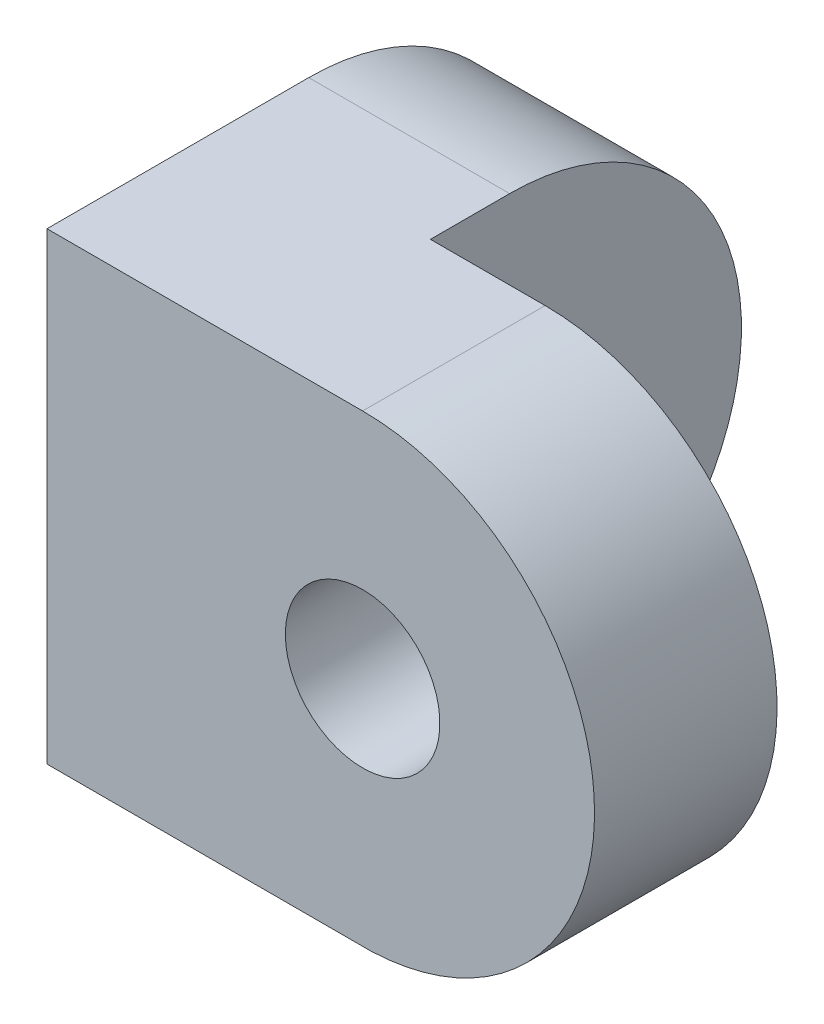
ISO-10303-21;
HEADER;
FILE_DESCRIPTION(('STEP AP214'),'2;1');
FILE_NAME('part.step','',(''),(''),'','','');
FILE_SCHEMA(('AUTOMOTIVE_DESIGN { 1 0 10303 214 1 1 1 1 }'));
ENDSEC;
DATA;
#1=APPLICATION_CONTEXT('core data for automotive mechanical design processes');
#2=APPLICATION_PROTOCOL_DEFINITION('international standard','automotive_design',2000,#1);
#3=PRODUCT_CONTEXT('',#1,'mechanical');
#4=PRODUCT('Part','Part','',(#3));
#5=PRODUCT_RELATED_PRODUCT_CATEGORY('part','',(#4));
#6=PRODUCT_DEFINITION_FORMATION('','',#4);
#7=PRODUCT_DEFINITION_CONTEXT('part definition',#1,'design');
#8=PRODUCT_DEFINITION('design','',#6,#7);
#9=PRODUCT_DEFINITION_SHAPE('','',#8);
#10=(LENGTH_UNIT() NAMED_UNIT(*) SI_UNIT(.MILLI.,.METRE.));
#11=(NAMED_UNIT(*) PLANE_ANGLE_UNIT() SI_UNIT($,.RADIAN.));
#12=(NAMED_UNIT(*) SI_UNIT($,.STERADIAN.) SOLID_ANGLE_UNIT());
#13=UNCERTAINTY_MEASURE_WITH_UNIT(LENGTH_MEASURE(1.E-05),#10,'distance_accuracy_value','');
#14=(GEOMETRIC_REPRESENTATION_CONTEXT(3) GLOBAL_UNCERTAINTY_ASSIGNED_CONTEXT((#13)) GLOBAL_UNIT_ASSIGNED_CONTEXT((#10,
#11,#12)) REPRESENTATION_CONTEXT('',''));
#15=CARTESIAN_POINT('',(0.,0.,0.));
#16=DIRECTION('',(0.,0.,1.));
#17=DIRECTION('',(1.,0.,0.));
#18=AXIS2_PLACEMENT_3D('',#15,#16,#17);
#19=CARTESIAN_POINT('',(0.,0.,-1.35000000000002));
#20=DIRECTION('',(0.,0.,-1.));
#21=DIRECTION('',(-1.,0.,0.));
#22=AXIS2_PLACEMENT_3D('',#19,#20,#21);
#23=PLANE('',#22);
#24=CARTESIAN_POINT('',(9.4278470507973,-0.00660032409642401,-1.35000000000002));
#25=DIRECTION('',(0.,0.,-1.));
#26=DIRECTION('',(-1.,0.,0.));
#27=AXIS2_PLACEMENT_3D('',#24,#25,#26);
#28=CIRCLE('',#27,6.35);
#29=CARTESIAN_POINT('',(3.0778470507973,-0.00660032409642401,-1.35000000000002));
#30=VERTEX_POINT('',#29);
#31=EDGE_CURVE('E198',#30,#30,#28,.T.);
#32=ORIENTED_EDGE('',*,*,#31,.T.);
#33=EDGE_LOOP('',(#32));
#34=FACE_BOUND('',#33,.T.);
#35=DIRECTION('',(1.,0.,0.));
#36=VECTOR('',#35,1.);
#37=CARTESIAN_POINT('',(-16.51,-19.05,-1.35000000000002));
#38=LINE('',#37,#36);
#39=CARTESIAN_POINT('',(-16.51,-19.05,-1.35000000000002));
#40=VERTEX_POINT('',#39);
#41=CARTESIAN_POINT('',(10.1370329898484,-19.05,-1.35000000000002));
#42=VERTEX_POINT('',#41);
#43=EDGE_CURVE('E190',#40,#42,#38,.T.);
#44=ORIENTED_EDGE('',*,*,#43,.T.);
#45=CARTESIAN_POINT('',(9.4278470507973,-0.00660032409642401,-1.35000000000002));
#46=DIRECTION('',(0.,0.,-1.));
#47=DIRECTION('',(-1.,0.,0.));
#48=AXIS2_PLACEMENT_3D('',#45,#46,#47);
#49=CIRCLE('',#48,19.0566003240964);
#50=CARTESIAN_POINT('',(9.4278470507973,19.05,-1.35000000000002));
#51=VERTEX_POINT('',#50);
#52=EDGE_CURVE('E61',#51,#42,#49,.T.);
#53=ORIENTED_EDGE('',*,*,#52,.F.);
#54=DIRECTION('',(-1.,0.,0.));
#55=VECTOR('',#54,1.);
#56=CARTESIAN_POINT('',(-16.51,19.05,-1.35000000000002));
#57=LINE('',#56,#55);
#58=CARTESIAN_POINT('',(-16.51,19.05,-1.35000000000002));
#59=VERTEX_POINT('',#58);
#60=EDGE_CURVE('E196',#51,#59,#57,.T.);
#61=ORIENTED_EDGE('',*,*,#60,.T.);
#62=DIRECTION('',(0.,-1.,0.));
#63=VECTOR('',#62,1.);
#64=CARTESIAN_POINT('',(-16.51,19.05,-1.35000000000002));
#65=LINE('',#64,#63);
#66=EDGE_CURVE('E193',#59,#40,#65,.T.);
#67=ORIENTED_EDGE('',*,*,#66,.T.);
#68=EDGE_LOOP('',(#44,#53,#61,#67));
#69=FACE_BOUND('',#68,.T.);
#70=ADVANCED_FACE('F54',(#34,#69),#23,.F.);
#71=CARTESIAN_POINT('',(0.,0.,-16.35));
#72=DIRECTION('',(0.,0.,-1.));
#73=DIRECTION('',(-1.,0.,0.));
#74=AXIS2_PLACEMENT_3D('',#71,#72,#73);
#75=PLANE('',#74);
#76=CARTESIAN_POINT('',(9.4278470507973,-0.00660032409642401,-16.35));
#77=DIRECTION('',(0.,0.,-1.));
#78=DIRECTION('',(-1.,0.,0.));
#79=AXIS2_PLACEMENT_3D('',#76,#77,#78);
#80=CIRCLE('',#79,6.35);
#81=CARTESIAN_POINT('',(3.0778470507973,-0.00660032409642401,-16.35));
#82=VERTEX_POINT('',#81);
#83=EDGE_CURVE('E201',#82,#82,#80,.T.);
#84=ORIENTED_EDGE('',*,*,#83,.F.);
#85=EDGE_LOOP('',(#84));
#86=FACE_BOUND('',#85,.T.);
#87=CARTESIAN_POINT('',(9.4278470507973,-0.00660032409642401,-16.35));
#88=DIRECTION('',(0.,0.,-1.));
#89=DIRECTION('',(-1.,0.,0.));
#90=AXIS2_PLACEMENT_3D('',#87,#88,#89);
#91=CIRCLE('',#90,19.0566003240964);
#92=CARTESIAN_POINT('',(9.4278470507973,19.05,-16.35));
#93=VERTEX_POINT('',#92);
#94=CARTESIAN_POINT('',(10.1370329898484,-19.05,-16.35));
#95=VERTEX_POINT('',#94);
#96=EDGE_CURVE('E68',#93,#95,#91,.T.);
#97=ORIENTED_EDGE('',*,*,#96,.T.);
#98=DIRECTION('',(1.,0.,0.));
#99=VECTOR('',#98,1.);
#100=CARTESIAN_POINT('',(-16.51,-19.05,-16.35));
#101=LINE('',#100,#99);
#102=CARTESIAN_POINT('',(0.,-19.05,-16.35));
#103=VERTEX_POINT('',#102);
#104=EDGE_CURVE('E182',#103,#95,#101,.T.);
#105=ORIENTED_EDGE('',*,*,#104,.F.);
#106=DIRECTION('',(0.,1.,0.));
#107=VECTOR('',#106,1.);
#108=CARTESIAN_POINT('',(0.,0.,-16.35));
#109=LINE('',#108,#107);
#110=CARTESIAN_POINT('',(0.,-7.62,-16.35));
#111=VERTEX_POINT('',#110);
#112=EDGE_CURVE('E170',#103,#111,#109,.T.);
#113=ORIENTED_EDGE('',*,*,#112,.T.);
#114=DIRECTION('',(1.,0.,0.));
#115=VECTOR('',#114,1.);
#116=CARTESIAN_POINT('',(0.,-7.62,-16.35));
#117=LINE('',#116,#115);
#118=CARTESIAN_POINT('',(-2.29294570367464,-7.62,-16.35));
#119=VERTEX_POINT('',#118);
#120=EDGE_CURVE('E161',#119,#111,#117,.T.);
#121=ORIENTED_EDGE('',*,*,#120,.F.);
#122=DIRECTION('',(0.,1.,0.));
#123=VECTOR('',#122,1.);
#124=CARTESIAN_POINT('',(-2.29294570367464,7.62,-16.35));
#125=LINE('',#124,#123);
#126=CARTESIAN_POINT('',(-2.29294570367464,7.62,-16.35));
#127=VERTEX_POINT('',#126);
#128=EDGE_CURVE('E147',#127,#119,#125,.F.);
#129=ORIENTED_EDGE('',*,*,#128,.F.);
#130=DIRECTION('',(1.,0.,0.));
#131=VECTOR('',#130,1.);
#132=CARTESIAN_POINT('',(0.,7.62,-16.35));
#133=LINE('',#132,#131);
#134=CARTESIAN_POINT('',(0.,7.62,-16.35));
#135=VERTEX_POINT('',#134);
#136=EDGE_CURVE('E180',#127,#135,#133,.T.);
#137=ORIENTED_EDGE('',*,*,#136,.T.);
#138=CARTESIAN_POINT('',(0.,19.05,-16.35));
#139=VERTEX_POINT('',#138);
#140=EDGE_CURVE('E186',#135,#139,#109,.T.);
#141=ORIENTED_EDGE('',*,*,#140,.T.);
#142=DIRECTION('',(-1.,0.,0.));
#143=VECTOR('',#142,1.);
#144=CARTESIAN_POINT('',(-16.51,19.05,-16.35));
#145=LINE('',#144,#143);
#146=EDGE_CURVE('E187',#93,#139,#145,.T.);
#147=ORIENTED_EDGE('',*,*,#146,.F.);
#148=EDGE_LOOP('',(#97,#105,#113,#121,#129,#137,#141,#147));
#149=FACE_BOUND('',#148,.T.);
#150=ADVANCED_FACE('F169',(#86,#149),#75,.T.);
#151=CARTESIAN_POINT('',(0.,-19.05,-12.2003602764011));
#152=DIRECTION('',(0.,-1.,0.));
#153=DIRECTION('',(0.,0.,-1.));
#154=AXIS2_PLACEMENT_3D('',#151,#152,#153);
#155=PLANE('',#154);
#156=ORIENTED_EDGE('',*,*,#104,.T.);
#157=DIRECTION('',(0.,0.,-1.));
#158=VECTOR('',#157,1.);
#159=CARTESIAN_POINT('',(10.1370329898484,-19.05,11.65));
#160=LINE('',#159,#158);
#161=EDGE_CURVE('E13',#42,#95,#160,.T.);
#162=ORIENTED_EDGE('',*,*,#161,.F.);
#163=ORIENTED_EDGE('',*,*,#43,.F.);
#164=DIRECTION('',(0.,0.,1.));
#165=VECTOR('',#164,1.);
#166=CARTESIAN_POINT('',(-16.51,-19.05,-12.2003602764011));
#167=LINE('',#166,#165);
#168=CARTESIAN_POINT('',(-16.51,-19.05,-22.86));
#169=VERTEX_POINT('',#168);
#170=EDGE_CURVE('E270',#169,#40,#167,.T.);
#171=ORIENTED_EDGE('',*,*,#170,.F.);
#172=DIRECTION('',(-1.,0.,0.));
#173=VECTOR('',#172,1.);
#174=CARTESIAN_POINT('',(0.,-19.05,-22.86));
#175=LINE('',#174,#173);
#176=CARTESIAN_POINT('',(0.,-19.05,-22.86));
#177=VERTEX_POINT('',#176);
#178=EDGE_CURVE('E232',#177,#169,#175,.T.);
#179=ORIENTED_EDGE('',*,*,#178,.F.);
#180=DIRECTION('',(0.,0.,1.));
#181=VECTOR('',#180,1.);
#182=CARTESIAN_POINT('',(0.,-19.05,-12.2003602764011));
#183=LINE('',#182,#181);
#184=EDGE_CURVE('E185',#177,#103,#183,.T.);
#185=ORIENTED_EDGE('',*,*,#184,.T.);
#186=EDGE_LOOP('',(#156,#162,#163,#171,#179,#185));
#187=FACE_BOUND('',#186,.T.);
#188=ADVANCED_FACE('F305',(#187),#155,.T.);
#189=CARTESIAN_POINT('',(0.,7.62,0.));
#190=DIRECTION('',(0.,-1.,0.));
#191=DIRECTION('',(0.,0.,-1.));
#192=AXIS2_PLACEMENT_3D('',#189,#190,#191);
#193=PLANE('',#192);
#194=ORIENTED_EDGE('',*,*,#136,.F.);
#195=CARTESIAN_POINT('',(0.,7.62,0.));
#196=DIRECTION('',(0.,-1.,0.));
#197=DIRECTION('',(1.,0.,0.));
#198=AXIS2_PLACEMENT_3D('',#195,#196,#197);
#199=CIRCLE('',#198,16.51);
#200=CARTESIAN_POINT('',(-0.492835820895531,7.62,-16.5026426021302));
#201=VERTEX_POINT('',#200);
#202=EDGE_CURVE('E154',#127,#201,#199,.T.);
#203=ORIENTED_EDGE('',*,*,#202,.T.);
#204=CARTESIAN_POINT('',(-0.508000000000008,7.62,-17.0104162206573));
#205=DIRECTION('',(0.,1.,0.));
#206=DIRECTION('',(0.,0.,-1.));
#207=AXIS2_PLACEMENT_3D('',#204,#205,#206);
#208=CIRCLE('',#207,0.508);
#209=CARTESIAN_POINT('',(0.,7.62,-17.0104162206573));
#210=VERTEX_POINT('',#209);
#211=EDGE_CURVE('E176',#201,#210,#208,.T.);
#212=ORIENTED_EDGE('',*,*,#211,.T.);
#213=DIRECTION('',(0.,0.,1.));
#214=VECTOR('',#213,1.);
#215=CARTESIAN_POINT('',(0.,7.62,0.));
#216=LINE('',#215,#214);
#217=EDGE_CURVE('E171',#210,#135,#216,.T.);
#218=ORIENTED_EDGE('',*,*,#217,.T.);
#219=EDGE_LOOP('',(#194,#203,#212,#218));
#220=FACE_BOUND('',#219,.T.);
#221=ADVANCED_FACE('F217',(#220),#193,.T.);
#222=CARTESIAN_POINT('',(0.,-7.62,0.));
#223=DIRECTION('',(0.,-1.,0.));
#224=DIRECTION('',(0.,0.,-1.));
#225=AXIS2_PLACEMENT_3D('',#222,#223,#224);
#226=PLANE('',#225);
#227=CARTESIAN_POINT('',(0.,-7.62,0.));
#228=DIRECTION('',(0.,-1.,0.));
#229=DIRECTION('',(1.,0.,0.));
#230=AXIS2_PLACEMENT_3D('',#227,#228,#229);
#231=CIRCLE('',#230,16.51);
#232=CARTESIAN_POINT('',(-0.492835820895531,-7.62,-16.5026426021302));
#233=VERTEX_POINT('',#232);
#234=EDGE_CURVE('E151',#119,#233,#231,.T.);
#235=ORIENTED_EDGE('',*,*,#234,.F.);
#236=ORIENTED_EDGE('',*,*,#120,.T.);
#237=DIRECTION('',(0.,0.,1.));
#238=VECTOR('',#237,1.);
#239=CARTESIAN_POINT('',(0.,-7.62,0.));
#240=LINE('',#239,#238);
#241=CARTESIAN_POINT('',(0.,-7.62,-17.0104162206573));
#242=VERTEX_POINT('',#241);
#243=EDGE_CURVE('E240',#242,#111,#240,.T.);
#244=ORIENTED_EDGE('',*,*,#243,.F.);
#245=CARTESIAN_POINT('',(-0.508000000000008,-7.62,-17.0104162206573));
#246=DIRECTION('',(0.,-1.,0.));
#247=DIRECTION('',(0.,0.,-1.));
#248=AXIS2_PLACEMENT_3D('',#245,#246,#247);
#249=CIRCLE('',#248,0.508);
#250=EDGE_CURVE('E164',#242,#233,#249,.T.);
#251=ORIENTED_EDGE('',*,*,#250,.T.);
#252=EDGE_LOOP('',(#235,#236,#244,#251));
#253=FACE_BOUND('',#252,.T.);
#254=ADVANCED_FACE('F160',(#253),#226,.F.);
#255=CARTESIAN_POINT('',(0.,19.05,-12.2003593450785));
#256=DIRECTION('',(0.,-1.,0.));
#257=DIRECTION('',(0.,0.,-1.));
#258=AXIS2_PLACEMENT_3D('',#255,#256,#257);
#259=PLANE('',#258);
#260=ORIENTED_EDGE('',*,*,#60,.F.);
#261=DIRECTION('',(0.,0.,-1.));
#262=VECTOR('',#261,1.);
#263=CARTESIAN_POINT('',(9.4278470507973,19.05,11.65));
#264=LINE('',#263,#262);
#265=EDGE_CURVE('E173',#51,#93,#264,.T.);
#266=ORIENTED_EDGE('',*,*,#265,.T.);
#267=ORIENTED_EDGE('',*,*,#146,.T.);
#268=DIRECTION('',(0.,0.,1.));
#269=VECTOR('',#268,1.);
#270=CARTESIAN_POINT('',(0.,19.05,-12.2003593450785));
#271=LINE('',#270,#269);
#272=CARTESIAN_POINT('',(0.,19.05,-22.86));
#273=VERTEX_POINT('',#272);
#274=EDGE_CURVE('E214',#273,#139,#271,.T.);
#275=ORIENTED_EDGE('',*,*,#274,.F.);
#276=DIRECTION('',(-1.,0.,0.));
#277=VECTOR('',#276,1.);
#278=CARTESIAN_POINT('',(0.,19.05,-22.86));
#279=LINE('',#278,#277);
#280=CARTESIAN_POINT('',(-16.51,19.05,-22.86));
#281=VERTEX_POINT('',#280);
#282=EDGE_CURVE('E189',#273,#281,#279,.T.);
#283=ORIENTED_EDGE('',*,*,#282,.T.);
#284=DIRECTION('',(0.,0.,1.));
#285=VECTOR('',#284,1.);
#286=CARTESIAN_POINT('',(-16.51,19.05,-12.2003593450785));
#287=LINE('',#286,#285);
#288=EDGE_CURVE('E233',#281,#59,#287,.T.);
#289=ORIENTED_EDGE('',*,*,#288,.T.);
#290=EDGE_LOOP('',(#260,#266,#267,#275,#283,#289));
#291=FACE_BOUND('',#290,.T.);
#292=ADVANCED_FACE('F318',(#291),#259,.F.);
#293=CARTESIAN_POINT('',(0.,-2.47080343379448,-17.0104162206573));
#294=CARTESIAN_POINT('',(0.,-2.47080343379448,-16.5173606780295));
#295=CARTESIAN_POINT('',(-0.492835820895525,-2.47080343379447,-16.5026426021302));
#296=CARTESIAN_POINT('',(0.,-2.42585020521051,-16.9914284431866));
#297=CARTESIAN_POINT('',(-0.0181026267120879,-2.42641837451006,-16.5168200597163));
#298=CARTESIAN_POINT('',(-0.492835815357493,-2.41782990828727,-16.5026426022956));
#299=CARTESIAN_POINT('',(-3.42670208693879E-11,-2.38039472620747,-16.9728391206172));
#300=CARTESIAN_POINT('',(-0.034217885243063,-2.37987295796052,-16.5163039713277));
#301=CARTESIAN_POINT('',(-0.49162330535235,-2.36502273117497,-16.5026789208278));
#302=CARTESIAN_POINT('',(3.4255745166794E-11,-2.2884774661127,-16.9365033002393));
#303=CARTESIAN_POINT('',(-0.0622857144950367,-2.28508080830107,-16.5153516136378));
#304=CARTESIAN_POINT('',(-0.487136046660252,-2.25969251120678,-16.5028119879718));
#305=CARTESIAN_POINT('',(-6.63272592569366E-11,-2.24201553761269,-16.9187567913595));
#306=CARTESIAN_POINT('',(-0.0744051571676867,-2.23674721552691,-16.5149114828303));
#307=CARTESIAN_POINT('',(-0.483860033668089,-2.20716941784303,-16.5029087394023));
#308=CARTESIAN_POINT('',(6.63148993521702E-11,-2.14809521306224,-16.8841576758096));
#309=CARTESIAN_POINT('',(-0.0951926291224509,-2.13891745320589,-16.5141076183176));
#310=CARTESIAN_POINT('',(-0.475522518818323,-2.10236883533562,-16.5031510847874));
#311=CARTESIAN_POINT('',(-9.32325486605717E-11,-2.10063686657033,-16.867305129888));
#312=CARTESIAN_POINT('',(-0.10397882404457,-2.08932635214853,-16.5137407875797));
#313=CARTESIAN_POINT('',(-0.470460272863881,-2.05009144848486,-16.5032966798234));
#314=CARTESIAN_POINT('',(9.32214897984124E-11,-2.00474522299128,-16.8345486778448));
#315=CARTESIAN_POINT('',(-0.118648962666236,-1.98932748575866,-16.5130774292742));
#316=CARTESIAN_POINT('',(-0.45877377594123,-1.94575152177126,-16.5036256862885));
#317=CARTESIAN_POINT('',(-1.13239960698824E-10,-1.95631195453371,-16.8186448182474));
#318=CARTESIAN_POINT('',(-0.12461700245205,-1.93882551823097,-16.5127784867147));
#319=CARTESIAN_POINT('',(-0.452149062002861,-1.89368904555168,-16.5038090976366));
#320=CARTESIAN_POINT('',(2.26462845213431E-10,-1.8095971108505,-16.7724410589735));
#321=CARTESIAN_POINT('',(-0.138676824169886,-1.78800228618753,-16.5119842022511));
#322=CARTESIAN_POINT('',(-0.430212791994755,-1.73778522510254,-16.5044003518945));
#323=CARTESIAN_POINT('',(-2.58595587784197E-10,-1.70989613020114,-16.7436494180072));
#324=CARTESIAN_POINT('',(-0.143553817673356,-1.68470986742093,-16.5115652485778));
#325=CARTESIAN_POINT('',(-0.412847282607445,-1.63422636430542,-16.5048489053222));
#326=CARTESIAN_POINT('',(2.58587239427469E-10,-1.50707493708387,-16.6905418112097));
#327=CARTESIAN_POINT('',(-0.145916106981836,-1.47733897079205,-16.5109212131377));
#328=CARTESIAN_POINT('',(-0.373857518966706,-1.42769418687915,-16.5057781040999));
#329=CARTESIAN_POINT('',(-2.31145179542759E-10,-1.40395521741463,-16.66622693742));
#330=CARTESIAN_POINT('',(-0.143641601108395,-1.37256267610745,-16.5106873154124));
#331=CARTESIAN_POINT('',(-0.352228703319066,-1.32472149712788,-16.5062586969718));
#332=CARTESIAN_POINT('',(1.15564376939923E-10,-1.2470848034734,-16.6334332701091));
#333=CARTESIAN_POINT('',(-0.136162120991499,-1.21428352106336,-16.5104314179135));
#334=CARTESIAN_POINT('',(-0.317339080059257,-1.17059868233714,-16.5069540259845));
#335=CARTESIAN_POINT('',(-1.00354772379525E-10,-1.19443052848507,-16.6231148397081));
#336=CARTESIAN_POINT('',(-0.133034285514288,-1.16168967751934,-16.5103618022923));
#337=CARTESIAN_POINT('',(-0.305300199509003,-1.11928062263539,-16.5071816302164));
#338=CARTESIAN_POINT('',(1.00345990341927E-10,-1.08846716765434,-16.6037519220301));
#339=CARTESIAN_POINT('',(-0.125659754861579,-1.0564042880148,-16.5102469942622));
#340=CARTESIAN_POINT('',(-0.280518235670358,-1.01674125899329,-16.5076213642133));
#341=CARTESIAN_POINT('',(-6.11735545888323E-11,-1.03515997436245,-16.5947083381036));
#342=CARTESIAN_POINT('',(-0.121418698022571,-1.00363514786603,-16.5102014624399));
#343=CARTESIAN_POINT('',(-0.26777536073798,-0.965522013406075,-16.5078334753474));
#344=CARTESIAN_POINT('',(1.22335562424528E-10,-0.874565410380079,-16.569580422201));
#345=CARTESIAN_POINT('',(-0.10737801639171,-0.846107321662737,-16.5100926824221));
#346=CARTESIAN_POINT('',(-0.228700062156138,-0.812165784561425,-16.5084364812676));
#347=CARTESIAN_POINT('',(-6.39429497394127E-11,-0.766533946015284,-16.55548811156));
#348=CARTESIAN_POINT('',(-0.096135877147097,-0.740231812906555,-16.5100547230453));
#349=CARTESIAN_POINT('',(-0.201506933581504,-0.710262773664207,-16.508793880648));
#350=CARTESIAN_POINT('',(6.39315114064931E-11,-0.549128761891025,-16.532844079357));
#351=CARTESIAN_POINT('',(-0.0713410751076463,-0.529027737522396,-16.5100111179178));
#352=CARTESIAN_POINT('',(-0.14563738044608,-0.506890658487023,-16.5093812782738));
#353=CARTESIAN_POINT('',(-1.75489898484399E-11,-0.439755957930929,-16.5242928582445));
#354=CARTESIAN_POINT('',(-0.0577452850593692,-0.423095381598784,-16.5100048117641));
#355=CARTESIAN_POINT('',(-0.116959876028162,-0.405421870284814,-16.5096112587423));
#356=CARTESIAN_POINT('',(8.7668309701132E-12,-0.275181400302846,-16.5157275618828));
#357=CARTESIAN_POINT('',(-0.0365142636575117,-0.264407096547718,-16.5100006904142));
#358=CARTESIAN_POINT('',(-0.0733951791592532,-0.253378956030786,-16.5098432466673));
#359=CARTESIAN_POINT('',(-2.26119469399737E-12,-0.220237692574851,-16.513582037586));
#360=CARTESIAN_POINT('',(-0.0292993784452398,-0.211544653485153,-16.5100003013968));
#361=CARTESIAN_POINT('',(-0.058781927624949,-0.20272477799028,-16.5099018643779));
#362=CARTESIAN_POINT('',(1.12301470805486E-12,-0.137757524470639,-16.5114348658008));
#363=CARTESIAN_POINT('',(-0.018373825229844,-0.132276389677549,-16.5100000432196));
#364=CARTESIAN_POINT('',(-0.0367934998544477,-0.126763505100161,-16.509960628662));
#365=CARTESIAN_POINT('',(-2.89640227567097E-13,-0.11025337790287,-16.5108976149188));
#366=CARTESIAN_POINT('',(-0.0147148219549663,-0.105857841829748,-16.5100000189203));
#367=CARTESIAN_POINT('',(-0.0294525894659155,-0.101446415932324,-16.509975363944));
#368=CARTESIAN_POINT('',(1.36891885397248E-13,-0.0689890604390588,-16.5103598735491));
#369=CARTESIAN_POINT('',(-0.00921344386478891,-0.0662331573016124,-16.5100000027186));
#370=CARTESIAN_POINT('',(-0.0184326450838461,-0.0634732750213932,-16.5099901190419));
#371=CARTESIAN_POINT('',(0.,-0.0552329380803816,-16.5102253126449));
#372=CARTESIAN_POINT('',(-0.00737750678148755,-0.0530254548381653,-16.5100000011925));
#373=CARTESIAN_POINT('',(-0.0147578995635723,-0.050815977130237,-16.5099938132463));
#374=CARTESIAN_POINT('',(0.,-0.0345977378865829,-16.510090527343));
#375=CARTESIAN_POINT('',(-0.00462198968569836,-0.0332142891994499,-16.5100000001726));
#376=CARTESIAN_POINT('',(-0.00924470623911855,-0.0318303403576202,-16.5099975140115));
#377=CARTESIAN_POINT('',(0.,-0.0277191680702581,-16.5100567747319));
#378=CARTESIAN_POINT('',(-0.00370321507619421,-0.0266106329944108,-16.5100000000749));
#379=CARTESIAN_POINT('',(-0.00740679560949419,-0.0255018465458741,-16.5099984408729));
#380=CARTESIAN_POINT('',(0.,-0.0191208490902456,-16.5100285551504));
#381=CARTESIAN_POINT('',(-0.00255457526722199,-0.0183560801483364,-16.5100000000218));
#382=CARTESIAN_POINT('',(-0.00510929487177441,-0.0175912612312864,-16.5099992158161));
#383=CARTESIAN_POINT('',(-1.19524591289662E-11,-0.017411860917206,-16.5100236353284));
#384=CARTESIAN_POINT('',(-0.00232626714680534,-0.0167154355488397,-16.5100000000159));
#385=CARTESIAN_POINT('',(-0.00465264309488871,-0.0160189724098364,-16.5099993509223));
#386=CARTESIAN_POINT('',(1.19419881076712E-11,-0.013945006828822,-16.5100150754848));
#387=CARTESIAN_POINT('',(-0.00186310931916602,-0.0133872328599666,-16.5100000000066));
#388=CARTESIAN_POINT('',(-0.00372627273593462,-0.0128294365547878,-16.5099995859913));
#389=CARTESIAN_POINT('',(0.,-0.0121943495127727,-16.5100114698863));
#390=CARTESIAN_POINT('',(-0.00162922209780721,-0.0117065930792442,-16.5099999999977));
#391=CARTESIAN_POINT('',(-0.00325848021834205,-0.0112188217158292,-16.5099996850088));
#392=CARTESIAN_POINT('',(0.,-0.00696820896799853,-16.5100028674805));
#393=CARTESIAN_POINT('',(0.,-0.00668948975629134,-16.5099999999988));
#394=CARTESIAN_POINT('',(-0.00186199862528698,-0.00641075220614669,-16.5099999212508));
#395=CARTESIAN_POINT('',(0.,-0.00348411328400941,-16.51));
#396=CARTESIAN_POINT('',(0.,-0.00334474745509645,-16.51));
#397=CARTESIAN_POINT('',(0.,-0.00320537914718702,-16.51));
#398=CARTESIAN_POINT('',(0.,0.,-16.51));
#399=CARTESIAN_POINT('',(0.,0.,-16.51));
#400=CARTESIAN_POINT('',(0.,0.,-16.51));
#401=(BOUNDED_SURFACE() B_SPLINE_SURFACE(3,2,((#293,#294,#295),(#296,#297,#298),(#299,#300,
#301),(#302,#303,#304),(#305,#306,#307),(#308,#309,#310),(#311,#312,#313),(#314,#315,#316),
(#317,#318,#319),(#320,#321,#322),(#323,#324,#325),(#326,#327,#328),(#329,#330,#331),(#332,#333,
#334),(#335,#336,#337),(#338,#339,#340),(#341,#342,#343),(#344,#345,#346),(#347,#348,#349),
(#350,#351,#352),(#353,#354,#355),(#356,#357,#358),(#359,#360,#361),(#362,#363,#364),(#365,#366,
#367),(#368,#369,#370),(#371,#372,#373),(#374,#375,#376),(#377,#378,#379),(#380,#381,#382),
(#383,#384,#385),(#386,#387,#388),(#389,#390,#391),(#392,#393,#394),(#395,#396,#397),(#398,#399,
#400)),.UNSPECIFIED.,.F.,.F.,.F.) B_SPLINE_SURFACE_WITH_KNOTS((4,2,2,2,2,2,2,2,2,2,2,2,2,2,2,2,
2,4),(3,3),(0.00133861646434972,0.00149922187738974,0.00165982729042976,0.00182043270346978,
0.0019810381165098,0.00230224894258983,0.00262345976866987,0.00278406518170989,
0.00294467059474991,0.00326588142082994,0.00358709224690998,0.00374769765995,
0.00382800036647001,0.00386815171973001,0.00388822739636002,0.00389324631551752,
0.00389826523467502,0.00390830307299002),(0.,1.),
.UNSPECIFIED.) GEOMETRIC_REPRESENTATION_ITEM() RATIONAL_B_SPLINE_SURFACE(((1.,0.717583007835568,
1.),(1.,0.730598401766169,1.),(1.,0.74296470633691,1.),(1.,0.766557204070007,1.),(1.,
0.777783646915097,1.),(1.,0.799214045392652,1.),(1.,0.809417612381667,1.),(1.,0.828887323310088,
1.),(1.,0.838153218473062,1.),(1.,0.864639820379174,1.),(1.,0.880554778827153,1.),(1.,
0.909234354954029,1.),(1.,0.921996303078545,1.),(1.,0.938915671048844,1.),(1.,0.944183994405832,
1.),(1.,0.953993126651055,1.),(1.,0.958533438696513,1.),(1.,0.971067310981841,1.),(1.,
0.977982044746351,1.),(1.,0.989017562213703,1.),(1.,0.993137785159824,1.),(1.,0.997255656915692,
1.),(1.,0.998284253424378,1.),(1.,0.999313065052126,1.),(1.,0.999570307377648,1.),(1.,
0.99982774848033,1.),(1.,0.999892157598886,1.),(1.,0.999956671859983,1.),(1.,0.999972826657282,
1.),(1.,0.999986333096788,1.),(1.,0.999988688479922,1.),(1.,0.999992784010366,1.),(1.,
0.999994510372203,1.),(1.,0.99999862759577,1.),(1.,1.00000000003267,1.),(1.,1.,1.))) REPRESENTATION_ITEM('') SURFACE());
#402=CARTESIAN_POINT('',(0.,0.,-22.86));
#403=DIRECTION('',(1.,0.,0.));
#404=DIRECTION('',(0.,0.,-1.));
#405=AXIS2_PLACEMENT_3D('',#402,#403,#404);
#406=CIRCLE('',#405,6.35);
#407=CARTESIAN_POINT('',(0.,0.,-16.51));
#408=VERTEX_POINT('',#407);
#409=CARTESIAN_POINT('',(0.,-2.47080343379446,-17.0104162206573));
#410=VERTEX_POINT('',#409);
#411=EDGE_CURVE('E244',#408,#410,#406,.T.);
#412=CARTESIAN_POINT('',(-0.492835820895527,-2.47080343379444,-16.5026426021302));
#413=CARTESIAN_POINT('',(-0.492835820895527,-2.41775121215402,-16.5026426021302));
#414=CARTESIAN_POINT('',(-0.491619779378875,-2.36487666710773,-16.5026790265759));
#415=CARTESIAN_POINT('',(-0.48712212940983,-2.25942937369777,-16.5028123994883));
#416=CARTESIAN_POINT('',(-0.483839235650318,-2.20685681301001,-16.5029093510549));
#417=CARTESIAN_POINT('',(-0.471310740230888,-2.04953065639666,-16.5032734936587));
#418=CARTESIAN_POINT('',(-0.459401458510774,-1.94516622923559,-16.5036136867085));
#419=CARTESIAN_POINT('',(-0.430125899709238,-1.73723451211337,-16.5044026287107));
#420=CARTESIAN_POINT('',(-0.412749736732923,-1.63366866548504,-16.5048513518432));
#421=CARTESIAN_POINT('',(-0.373748416400727,-1.42715746876609,-16.5057805817493));
#422=CARTESIAN_POINT('',(-0.352118652077861,-1.32421279116095,-16.5062610390689));
#423=CARTESIAN_POINT('',(-0.31723533499106,-1.17015175256935,-16.5069560186302));
#424=CARTESIAN_POINT('',(-0.305199828439153,-1.11885759119602,-16.507183482831));
#425=CARTESIAN_POINT('',(-0.280427032545951,-1.01637168141597,-16.5076229103571));
#426=CARTESIAN_POINT('',(-0.267689960303731,-0.96518185010416,-16.5078348570122));
#427=CARTESIAN_POINT('',(-0.228627600316689,-0.811891441037958,-16.5084374713451));
#428=CARTESIAN_POINT('',(-0.201439717196181,-0.710013570339242,-16.5087946969384));
#429=CARTESIAN_POINT('',(-0.145574910882172,-0.506667799378149,-16.5093818252122));
#430=CARTESIAN_POINT('',(-0.116896949351766,-0.405200185159647,-16.5096117078294));
#431=CARTESIAN_POINT('',(-0.073329342143739,-0.253150219088635,-16.5098435400702));
#432=CARTESIAN_POINT('',(-0.0514074725470499,-0.177163210438967,-16.5099313869986));
#433=CARTESIAN_POINT('',(-0.0257115889495187,-0.0885447441114792,-16.5099828422168));
#434=CARTESIAN_POINT('',(-0.0128486000433766,-0.0442396262899552,-16.5099957166344));
#435=CARTESIAN_POINT('',(-0.00733427962179808,-0.0252521559325331,-16.5099984732679));
#436=CARTESIAN_POINT('',(-0.00365788710504286,-0.0125938901936677,-16.5099996971178));
#437=CARTESIAN_POINT('',(-0.00183024735909886,-0.00630150048183099,-16.51));
#438=CARTESIAN_POINT('',(0.,0.,-16.51));
#439=(BOUNDED_CURVE() B_SPLINE_CURVE(3,(#412,#413,#414,#415,#416,#417,#418,#419,#420,#421,#422,
#423,#424,#425,#426,#427,#428,#429,#430,#431,#432,#433,#434,#435,#436,#437,#438),.UNSPECIFIED.,
.F.,.F.) B_SPLINE_CURVE_WITH_KNOTS((4,2,2,2,2,2,2,2,2,2,1,1,1,2,4),(0.,0.000157485932925415,
0.00031497186585083,0.00062994373170166,0.000944915597552491,0.00125988746340332,
0.00141737339632874,0.00157485932925415,0.00188983119510498,0.00220480306095581,
0.00236228899388122,0.00244103196034393,0.00248040344357528,0.00250008918519096,
0.00251977492680664),
.UNSPECIFIED.) CURVE() GEOMETRIC_REPRESENTATION_ITEM() RATIONAL_B_SPLINE_CURVE((1.,1.,1.,1.,1.,
1.,1.,1.,1.,1.,1.,1.,1.,1.,1.,1.,1.,1.,1.,1.,1.,1.,1.,1.,1.,1.,1.)) REPRESENTATION_ITEM(''));
#440=CARTESIAN_POINT('',(-0.492835820895527,-2.47080343379444,-16.5026426021302));
#441=VERTEX_POINT('',#440);
#442=EDGE_CURVE('E234',#441,#408,#439,.T.);
#443=CARTESIAN_POINT('',(-0.508,-2.47080343379444,-17.0104162206573));
#444=DIRECTION('',(0.,-1.,0.));
#445=DIRECTION('',(1.,0.,0.));
#446=AXIS2_PLACEMENT_3D('',#443,#444,#445);
#447=CIRCLE('',#446,0.508);
#448=EDGE_CURVE('E258',#410,#441,#447,.T.);
#449=ORIENTED_EDGE('',*,*,#411,.F.);
#450=ORIENTED_EDGE('',*,*,#442,.F.);
#451=ORIENTED_EDGE('',*,*,#448,.F.);
#452=EDGE_LOOP('',(#449,#450,#451));
#453=FACE_BOUND('',#452,.T.);
#454=ADVANCED_FACE('F286',(#453),#401,.T.);
#455=CARTESIAN_POINT('',(0.,0.,-22.86));
#456=DIRECTION('',(1.,0.,0.));
#457=DIRECTION('',(0.,0.,1.));
#458=AXIS2_PLACEMENT_3D('',#455,#456,#457);
#459=CYLINDRICAL_SURFACE('',#458,19.05);
#460=CARTESIAN_POINT('',(-16.51,0.,-22.86));
#461=DIRECTION('',(1.,0.,0.));
#462=DIRECTION('',(0.,-1.,0.));
#463=AXIS2_PLACEMENT_3D('',#460,#461,#462);
#464=CIRCLE('',#463,19.05);
#465=EDGE_CURVE('E229',#169,#281,#464,.T.);
#466=ORIENTED_EDGE('',*,*,#465,.T.);
#467=ORIENTED_EDGE('',*,*,#282,.F.);
#468=CARTESIAN_POINT('',(0.,0.,-22.86));
#469=DIRECTION('',(1.,0.,0.));
#470=DIRECTION('',(0.,-1.,0.));
#471=AXIS2_PLACEMENT_3D('',#468,#469,#470);
#472=CIRCLE('',#471,19.05);
#473=EDGE_CURVE('E253',#177,#273,#472,.T.);
#474=ORIENTED_EDGE('',*,*,#473,.F.);
#475=ORIENTED_EDGE('',*,*,#178,.T.);
#476=EDGE_LOOP('',(#466,#467,#474,#475));
#477=FACE_BOUND('',#476,.T.);
#478=ADVANCED_FACE('F328',(#477),#459,.T.);
#479=CARTESIAN_POINT('',(-16.51,0.,-22.86));
#480=DIRECTION('',(1.,0.,0.));
#481=DIRECTION('',(0.,1.,0.));
#482=AXIS2_PLACEMENT_3D('',#479,#480,#481);
#483=PLANE('',#482);
#484=CARTESIAN_POINT('',(-16.51,0.,-22.86));
#485=DIRECTION('',(1.,0.,0.));
#486=DIRECTION('',(0.,0.,-1.));
#487=AXIS2_PLACEMENT_3D('',#484,#485,#486);
#488=CIRCLE('',#487,6.35);
#489=CARTESIAN_POINT('',(-16.51,0.,-29.21));
#490=VERTEX_POINT('',#489);
#491=EDGE_CURVE('E256',#490,#490,#488,.T.);
#492=ORIENTED_EDGE('',*,*,#491,.T.);
#493=EDGE_LOOP('',(#492));
#494=FACE_BOUND('',#493,.T.);
#495=ORIENTED_EDGE('',*,*,#170,.T.);
#496=ORIENTED_EDGE('',*,*,#66,.F.);
#497=ORIENTED_EDGE('',*,*,#288,.F.);
#498=ORIENTED_EDGE('',*,*,#465,.F.);
#499=EDGE_LOOP('',(#495,#496,#497,#498));
#500=FACE_BOUND('',#499,.T.);
#501=ADVANCED_FACE('F323',(#494,#500),#483,.F.);
#502=CARTESIAN_POINT('',(0.,0.,-22.86));
#503=DIRECTION('',(1.,0.,0.));
#504=DIRECTION('',(0.,1.,0.));
#505=AXIS2_PLACEMENT_3D('',#502,#503,#504);
#506=PLANE('',#505);
#507=ORIENTED_EDGE('',*,*,#112,.F.);
#508=ORIENTED_EDGE('',*,*,#184,.F.);
#509=ORIENTED_EDGE('',*,*,#473,.T.);
#510=ORIENTED_EDGE('',*,*,#274,.T.);
#511=ORIENTED_EDGE('',*,*,#140,.F.);
#512=ORIENTED_EDGE('',*,*,#217,.F.);
#513=DIRECTION('',(0.,-1.,0.));
#514=VECTOR('',#513,1.);
#515=CARTESIAN_POINT('',(0.,0.,-17.0104162206573));
#516=LINE('',#515,#514);
#517=CARTESIAN_POINT('',(0.,2.47080343379444,-17.0104162206573));
#518=VERTEX_POINT('',#517);
#519=EDGE_CURVE('E226',#210,#518,#516,.T.);
#520=ORIENTED_EDGE('',*,*,#519,.T.);
#521=CARTESIAN_POINT('',(0.,0.,-22.86));
#522=DIRECTION('',(1.,0.,0.));
#523=DIRECTION('',(0.,0.,-1.));
#524=AXIS2_PLACEMENT_3D('',#521,#522,#523);
#525=CIRCLE('',#524,6.35);
#526=EDGE_CURVE('E247',#410,#518,#525,.T.);
#527=ORIENTED_EDGE('',*,*,#526,.F.);
#528=DIRECTION('',(0.,-1.,0.));
#529=VECTOR('',#528,1.);
#530=CARTESIAN_POINT('',(0.,-7.62,-17.0104162206573));
#531=LINE('',#530,#529);
#532=EDGE_CURVE('E228',#410,#242,#531,.T.);
#533=ORIENTED_EDGE('',*,*,#532,.T.);
#534=ORIENTED_EDGE('',*,*,#243,.T.);
#535=EDGE_LOOP('',(#507,#508,#509,#510,#511,#512,#520,#527,#533,#534));
#536=FACE_BOUND('',#535,.T.);
#537=ADVANCED_FACE('F210',(#536),#506,.T.);
#538=CARTESIAN_POINT('',(-46.355,0.,-22.86));
#539=DIRECTION('',(-1.,0.,0.));
#540=DIRECTION('',(0.,0.,-1.));
#541=AXIS2_PLACEMENT_3D('',#538,#539,#540);
#542=CYLINDRICAL_SURFACE('',#541,6.35);
#543=ORIENTED_EDGE('',*,*,#491,.F.);
#544=EDGE_LOOP('',(#543));
#545=FACE_BOUND('',#544,.T.);
#546=ORIENTED_EDGE('',*,*,#411,.T.);
#547=ORIENTED_EDGE('',*,*,#526,.T.);
#548=CARTESIAN_POINT('',(0.,0.,-22.86));
#549=DIRECTION('',(1.,0.,0.));
#550=DIRECTION('',(0.,0.,-1.));
#551=AXIS2_PLACEMENT_3D('',#548,#549,#550);
#552=CIRCLE('',#551,6.35);
#553=EDGE_CURVE('E259',#518,#408,#552,.T.);
#554=ORIENTED_EDGE('',*,*,#553,.T.);
#555=EDGE_LOOP('',(#546,#547,#554));
#556=FACE_BOUND('',#555,.T.);
#557=ADVANCED_FACE('F276',(#545,#556),#542,.F.);
#558=CARTESIAN_POINT('',(-0.508000000000008,7.62,-17.0104162206573));
#559=DIRECTION('',(0.,1.,0.));
#560=DIRECTION('',(0.,0.,-1.));
#561=AXIS2_PLACEMENT_3D('',#558,#559,#560);
#562=CYLINDRICAL_SURFACE('',#561,0.508);
#563=ORIENTED_EDGE('',*,*,#250,.F.);
#564=ORIENTED_EDGE('',*,*,#532,.F.);
#565=ORIENTED_EDGE('',*,*,#448,.T.);
#566=DIRECTION('',(0.,1.,0.));
#567=VECTOR('',#566,1.);
#568=CARTESIAN_POINT('',(-0.492835820895531,7.62,-16.5026426021302));
#569=LINE('',#568,#567);
#570=EDGE_CURVE('E166',#233,#441,#569,.T.);
#571=ORIENTED_EDGE('',*,*,#570,.F.);
#572=EDGE_LOOP('',(#563,#564,#565,#571));
#573=FACE_BOUND('',#572,.T.);
#574=ADVANCED_FACE('F288',(#573),#562,.T.);
#575=CARTESIAN_POINT('',(-0.508000000000008,7.62,-17.0104162206573));
#576=DIRECTION('',(0.,1.,0.));
#577=DIRECTION('',(0.,0.,-1.));
#578=AXIS2_PLACEMENT_3D('',#575,#576,#577);
#579=CYLINDRICAL_SURFACE('',#578,0.508);
#580=ORIENTED_EDGE('',*,*,#211,.F.);
#581=DIRECTION('',(0.,1.,0.));
#582=VECTOR('',#581,1.);
#583=CARTESIAN_POINT('',(-0.492835820895531,7.62,-16.5026426021302));
#584=LINE('',#583,#582);
#585=CARTESIAN_POINT('',(-0.492835820895531,2.47080343379444,-16.5026426021302));
#586=VERTEX_POINT('',#585);
#587=EDGE_CURVE('E204',#586,#201,#584,.T.);
#588=ORIENTED_EDGE('',*,*,#587,.F.);
#589=CARTESIAN_POINT('',(-0.508000000000008,2.47080343379444,-17.0104162206573));
#590=DIRECTION('',(0.,-1.,0.));
#591=DIRECTION('',(0.,0.,-1.));
#592=AXIS2_PLACEMENT_3D('',#589,#590,#591);
#593=CIRCLE('',#592,0.508);
#594=EDGE_CURVE('E157',#518,#586,#593,.T.);
#595=ORIENTED_EDGE('',*,*,#594,.F.);
#596=ORIENTED_EDGE('',*,*,#519,.F.);
#597=EDGE_LOOP('',(#580,#588,#595,#596));
#598=FACE_BOUND('',#597,.T.);
#599=ADVANCED_FACE('F281',(#598),#579,.T.);
#600=CARTESIAN_POINT('',(-0.492835820895525,2.47080343379448,-16.5026426021302));
#601=CARTESIAN_POINT('',(0.,2.47080343379448,-16.5173606780295));
#602=CARTESIAN_POINT('',(0.,2.47080343379448,-17.0104162206573));
#603=CARTESIAN_POINT('',(-0.492835815357493,2.41782990828728,-16.5026426022956));
#604=CARTESIAN_POINT('',(-0.0181026267121284,2.42641837451002,-16.516820059716));
#605=CARTESIAN_POINT('',(0.,2.42585020521045,-16.9914284431866));
#606=CARTESIAN_POINT('',(-0.49162330535235,2.36502273117498,-16.5026789208278));
#607=CARTESIAN_POINT('',(-0.0342178852429819,2.3798729579606,-16.5163039713277));
#608=CARTESIAN_POINT('',(-3.42603649666249E-11,2.38039472620756,-16.9728391206173));
#609=CARTESIAN_POINT('',(-0.487136046660252,2.25969251120679,-16.5028119879718));
#610=CARTESIAN_POINT('',(-0.0622857144951071,2.28508080830101,-16.5153516136378));
#611=CARTESIAN_POINT('',(3.42497397853345E-11,2.28847746611263,-16.9365033002392));
#612=CARTESIAN_POINT('',(-0.483860033668089,2.20716941784304,-16.5029087394023));
#613=CARTESIAN_POINT('',(-0.0744051571676087,2.23674721552687,-16.5149114828303));
#614=CARTESIAN_POINT('',(-6.6303197735083E-11,2.24201553761265,-16.9187567913596));
#615=CARTESIAN_POINT('',(-0.475522518818323,2.10236883533563,-16.5031510847874));
#616=CARTESIAN_POINT('',(-0.0951926291225199,2.13891745320595,-16.5141076183176));
#617=CARTESIAN_POINT('',(6.62919220324892E-11,2.14809521306229,-16.8841576758095));
#618=CARTESIAN_POINT('',(-0.470460272863879,2.05009144848484,-16.5032966798234));
#619=CARTESIAN_POINT('',(-0.103978824044614,2.08932635214844,-16.5137407875796));
#620=CARTESIAN_POINT('',(-9.32537505592083E-11,2.10063686657026,-16.8673051298879));
#621=CARTESIAN_POINT('',(-0.458773775941232,1.9457515217713,-16.5036256862885));
#622=CARTESIAN_POINT('',(-0.118648962666189,1.98932748575876,-16.5130774292743));
#623=CARTESIAN_POINT('',(9.32425832768317E-11,2.00474522299135,-16.8345486778449));
#624=CARTESIAN_POINT('',(-0.452149062002861,1.89368904555166,-16.5038090976366));
#625=CARTESIAN_POINT('',(-0.124617002452015,1.93882551823103,-16.5127784867147));
#626=CARTESIAN_POINT('',(-1.13217193944427E-10,1.9563119545338,-16.8186448182475));
#627=CARTESIAN_POINT('',(-0.430212791994755,1.7377852251026,-16.5044003518945));
#628=CARTESIAN_POINT('',(-0.138676824169947,1.78800228618745,-16.5119842022511));
#629=CARTESIAN_POINT('',(2.26420889571806E-10,1.80959711085033,-16.7724410589733));
#630=CARTESIAN_POINT('',(-0.412847282607444,1.63422636430538,-16.5048489053222));
#631=CARTESIAN_POINT('',(-0.143553817673366,1.684709867421,-16.5115652485779));
#632=CARTESIAN_POINT('',(-2.58548820984803E-10,1.70989613020136,-16.7436494180074));
#633=CARTESIAN_POINT('',(-0.373857518966708,1.42769418687921,-16.5057781040999));
#634=CARTESIAN_POINT('',(-0.145916106981826,1.47733897079199,-16.5109212131376));
#635=CARTESIAN_POINT('',(2.58537220021557E-10,1.50707493708366,-16.6905418112095));
#636=CARTESIAN_POINT('',(-0.352228703319066,1.32472149712788,-16.5062586969718));
#637=CARTESIAN_POINT('',(-0.1436416011084,1.37256267610745,-16.5106873154124));
#638=CARTESIAN_POINT('',(-2.31122257790117E-10,1.40395521741462,-16.66622693742));
#639=CARTESIAN_POINT('',(-0.317339080059257,1.17059868233714,-16.5069540259845));
#640=CARTESIAN_POINT('',(-0.1361621209915,1.21428352106337,-16.5104314179135));
#641=CARTESIAN_POINT('',(1.15550151348062E-10,1.24708480347341,-16.6334332701091));
#642=CARTESIAN_POINT('',(-0.305300199509003,1.11928062263542,-16.5071816302164));
#643=CARTESIAN_POINT('',(-0.1330342855142,1.16168967751933,-16.5103618022923));
#644=CARTESIAN_POINT('',(-1.00389695569432E-10,1.19443052848499,-16.623114839708));
#645=CARTESIAN_POINT('',(-0.280518235670358,1.01674125899326,-16.5076213642133));
#646=CARTESIAN_POINT('',(-0.125659754861663,1.05640428801481,-16.5102469942622));
#647=CARTESIAN_POINT('',(1.00378094606186E-10,1.08846716765442,-16.6037519220302));
#648=CARTESIAN_POINT('',(-0.267775360738367,0.965522013406033,-16.5078334753474));
#649=CARTESIAN_POINT('',(-0.121418698022802,1.003635147866,-16.5102014624399));
#650=CARTESIAN_POINT('',(-6.11586768069199E-11,1.03515997436245,-16.5947083381036));
#651=CARTESIAN_POINT('',(-0.228700062155365,0.81216578456152,-16.5084364812676));
#652=CARTESIAN_POINT('',(-0.107378016391258,0.846107321662836,-16.5100926824221));
#653=CARTESIAN_POINT('',(1.22305644230377E-10,0.874565410380091,-16.569580422201));
#654=CARTESIAN_POINT('',(-0.201506933581504,0.710262773664206,-16.508793880648));
#655=CARTESIAN_POINT('',(-0.096135877147088,0.740231812906638,-16.5100547230451));
#656=CARTESIAN_POINT('',(-6.39531392646457E-11,0.766533946015428,-16.55548811156));
#657=CARTESIAN_POINT('',(-0.14563738044608,0.506890658487021,-16.5093812782738));
#658=CARTESIAN_POINT('',(-0.0713410751076544,0.529027737522317,-16.510011117918));
#659=CARTESIAN_POINT('',(6.39414840912914E-11,0.549128761890885,-16.532844079357));
#660=CARTESIAN_POINT('',(-0.116959876028937,0.405421870284862,-16.5096112587423));
#661=CARTESIAN_POINT('',(-0.0577452850597433,0.423095381598752,-16.5100048117639));
#662=CARTESIAN_POINT('',(-1.75476979034549E-11,0.439755957930788,-16.5242928582445));
#663=CARTESIAN_POINT('',(-0.0733951791588658,0.253378956030765,-16.5098432466673));
#664=CARTESIAN_POINT('',(-0.0365142636573257,0.264407096547742,-16.5100006904143));
#665=CARTESIAN_POINT('',(8.76618499762067E-12,0.275181400302919,-16.5157275618828));
#666=CARTESIAN_POINT('',(-0.058781927624949,0.202724777990303,-16.5099018643779));
#667=CARTESIAN_POINT('',(-0.0292993784451619,0.211544653485226,-16.5100003013965));
#668=CARTESIAN_POINT('',(-2.26172461681488E-12,0.220237692574926,-16.513582037586));
#669=CARTESIAN_POINT('',(-0.0367934998544476,0.12676350510015,-16.509960628662));
#670=CARTESIAN_POINT('',(-0.0183738252298298,0.132276389677529,-16.5100000432198));
#671=CARTESIAN_POINT('',(1.12328983385899E-12,0.137757524470603,-16.5114348658008));
#672=CARTESIAN_POINT('',(-0.0294525894659155,0.101446415932314,-16.509975363944));
#673=CARTESIAN_POINT('',(-0.0147148219548712,0.105857841829753,-16.5100000189188));
#674=CARTESIAN_POINT('',(-2.89620493094961E-13,0.110253377902834,-16.5108976149188));
#675=CARTESIAN_POINT('',(-0.0184326450838461,0.0634732750213998,-16.5099901190419));
#676=CARTESIAN_POINT('',(-0.0092134438648347,0.0662331573016124,-16.5100000027193));
#677=CARTESIAN_POINT('',(1.36882018161179E-13,0.068989060439079,-16.5103598735491));
#678=CARTESIAN_POINT('',(-0.0147578995634755,0.0508159771302877,-16.5099938132463));
#679=CARTESIAN_POINT('',(-0.00737750678059342,0.0530254548384724,-16.5100000011918));
#680=CARTESIAN_POINT('',(0.,0.055232938080439,-16.5102253126449));
#681=CARTESIAN_POINT('',(-0.00924470623916694,0.0318303403575935,-16.5099975140115));
#682=CARTESIAN_POINT('',(-0.00462198968613505,0.0332142891992998,-16.5100000001727));
#683=CARTESIAN_POINT('',(0.,0.0345977378865564,-16.510090527343));
#684=CARTESIAN_POINT('',(-0.00740679560947956,0.0255018465458666,-16.5099984408729));
#685=CARTESIAN_POINT('',(-0.00370321507617044,0.0266106329944125,-16.5100000000719));
#686=CARTESIAN_POINT('',(0.,0.0277191680702598,-16.5100567747319));
#687=CARTESIAN_POINT('',(-0.00510929487175974,0.0175912612312894,-16.5099992158161));
#688=CARTESIAN_POINT('',(-0.00255457526721828,0.0183560801483377,-16.5100000000224));
#689=CARTESIAN_POINT('',(0.,0.0191208490902471,-16.5100285551504));
#690=CARTESIAN_POINT('',(-0.00465264309489938,0.0160189724098324,-16.5099993509223));
#691=CARTESIAN_POINT('',(-0.00232626714677326,0.0167154355488475,-16.510000000012));
#692=CARTESIAN_POINT('',(-1.19524602553885E-11,0.0174118609172039,-16.5100236353284));
#693=CARTESIAN_POINT('',(-0.00372627273589462,0.012829436554797,-16.5099995859913));
#694=CARTESIAN_POINT('',(-0.0018631093191932,0.0133872328599625,-16.5100000000072));
#695=CARTESIAN_POINT('',(1.19419909281594E-11,0.0139450068288329,-16.5100150754848));
#696=CARTESIAN_POINT('',(-0.00325848021772857,0.0112188217160153,-16.5099996850088));
#697=CARTESIAN_POINT('',(-0.0016292220975304,0.011706593079429,-16.5099999999997));
#698=CARTESIAN_POINT('',(0.,0.012194349512974,-16.5100114698863));
#699=CARTESIAN_POINT('',(-0.00186199862471029,0.00641075220632622,-16.5099999212508));
#700=CARTESIAN_POINT('',(0.,0.00668948975649096,-16.510000000001));
#701=CARTESIAN_POINT('',(0.,0.00696820896819278,-16.5100028674805));
#702=CARTESIAN_POINT('',(0.,0.00320537914718001,-16.51));
#703=CARTESIAN_POINT('',(0.,0.00334474745494469,-16.51));
#704=CARTESIAN_POINT('',(0.,0.00348411328384062,-16.51));
#705=CARTESIAN_POINT('',(0.,0.,-16.51));
#706=CARTESIAN_POINT('',(0.,0.,-16.51));
#707=CARTESIAN_POINT('',(0.,0.,-16.51));
#708=(BOUNDED_SURFACE() B_SPLINE_SURFACE(3,2,((#600,#601,#602),(#603,#604,#605),(#606,#607,
#608),(#609,#610,#611),(#612,#613,#614),(#615,#616,#617),(#618,#619,#620),(#621,#622,#623),
(#624,#625,#626),(#627,#628,#629),(#630,#631,#632),(#633,#634,#635),(#636,#637,#638),(#639,#640,
#641),(#642,#643,#644),(#645,#646,#647),(#648,#649,#650),(#651,#652,#653),(#654,#655,#656),
(#657,#658,#659),(#660,#661,#662),(#663,#664,#665),(#666,#667,#668),(#669,#670,#671),(#672,#673,
#674),(#675,#676,#677),(#678,#679,#680),(#681,#682,#683),(#684,#685,#686),(#687,#688,#689),
(#690,#691,#692),(#693,#694,#695),(#696,#697,#698),(#699,#700,#701),(#702,#703,#704),(#705,#706,
#707)),.UNSPECIFIED.,.F.,.F.,.F.) B_SPLINE_SURFACE_WITH_KNOTS((4,2,2,2,2,2,2,2,2,2,2,2,2,2,2,2,
2,4),(3,3),(0.00133861646434974,0.00149922187738975,0.00165982729042977,0.00182043270346979,
0.00198103811650981,0.00230224894258985,0.00262345976866989,0.00278406518170991,
0.00294467059474993,0.00326588142082996,0.00358709224691,0.00374769765995002,
0.00382800036647003,0.00386815171973003,0.00388822739636004,0.00389324631551754,
0.00389826523467504,0.00390830307299004),(0.,1.),
.UNSPECIFIED.) GEOMETRIC_REPRESENTATION_ITEM() RATIONAL_B_SPLINE_SURFACE(((1.,0.717583007835566,
1.),(1.,0.730598401766208,1.),(1.,0.742964706336852,1.),(1.,0.766557204070061,1.),(1.,
0.777783646915039,1.),(1.,0.799214045392705,1.),(1.,0.809417612381706,1.),(1.,0.828887323310046,
1.),(1.,0.838153218473028,1.),(1.,0.864639820379236,1.),(1.,0.880554778827147,1.),(1.,
0.909234354954036,1.),(1.,0.921996303078527,1.),(1.,0.938915671048853,1.),(1.,0.944183994405856,
1.),(1.,0.953993126651032,1.),(1.,0.958533438696413,1.),(1.,0.97106731098204,1.),(1.,
0.977982044746339,1.),(1.,0.989017562213715,1.),(1.,0.993137785159759,1.),(1.,0.997255656915725,
1.),(1.,0.998284253424381,1.),(1.,0.999313065052124,1.),(1.,0.999570307377648,1.),(1.,
0.99982774848033,1.),(1.,0.999892157598887,1.),(1.,0.999956671859983,1.),(1.,0.999972826657282,
1.),(1.,0.999986333096788,1.),(1.,0.999988688479921,1.),(1.,0.999992784010366,1.),(1.,
0.999994510372205,1.),(1.,0.999998627595771,1.),(1.,1.00000000003267,1.),(1.,1.,1.))) REPRESENTATION_ITEM('') SURFACE());
#709=CARTESIAN_POINT('',(0.,0.,-16.51));
#710=CARTESIAN_POINT('',(-0.00183024735913347,0.00630150048182092,-16.51));
#711=CARTESIAN_POINT('',(-0.00365788710504736,0.0125938901936656,-16.5099996971178));
#712=CARTESIAN_POINT('',(-0.00733427962180022,0.0252521559325317,-16.5099984732679));
#713=CARTESIAN_POINT('',(-0.0128486000433704,0.0442396262899573,-16.5099957166344));
#714=CARTESIAN_POINT('',(-0.0257115889495196,0.0885447441114774,-16.5099828422168));
#715=CARTESIAN_POINT('',(-0.0514074725470472,0.177163210438968,-16.5099313869986));
#716=CARTESIAN_POINT('',(-0.0733293421437386,0.253150219088635,-16.5098435400702));
#717=CARTESIAN_POINT('',(-0.116896949351766,0.405200185159648,-16.5096117078294));
#718=CARTESIAN_POINT('',(-0.145574910882172,0.506667799378151,-16.5093818252122));
#719=CARTESIAN_POINT('',(-0.201439717196181,0.710013570339243,-16.5087946969384));
#720=CARTESIAN_POINT('',(-0.228627600316689,0.81189144103796,-16.5084374713452));
#721=CARTESIAN_POINT('',(-0.267689960303732,0.965181850104161,-16.5078348570122));
#722=CARTESIAN_POINT('',(-0.280427032545951,1.01637168141598,-16.5076229103571));
#723=CARTESIAN_POINT('',(-0.305199828439153,1.11885759119603,-16.507183482831));
#724=CARTESIAN_POINT('',(-0.317235334991056,1.17015175256936,-16.5069560186301));
#725=CARTESIAN_POINT('',(-0.352118652077857,1.32421279116096,-16.5062610390689));
#726=CARTESIAN_POINT('',(-0.373748416400726,1.42715746876609,-16.5057805817493));
#727=CARTESIAN_POINT('',(-0.412749736732923,1.63366866548505,-16.5048513518432));
#728=CARTESIAN_POINT('',(-0.43012589970924,1.73723451211337,-16.5044026287107));
#729=CARTESIAN_POINT('',(-0.459401458510775,1.94516622923559,-16.5036136867085));
#730=CARTESIAN_POINT('',(-0.471310740230888,2.04953065639666,-16.5032734936587));
#731=CARTESIAN_POINT('',(-0.483839235650318,2.20685681301002,-16.5029093510549));
#732=CARTESIAN_POINT('',(-0.48712212940983,2.25942937369778,-16.5028123994883));
#733=CARTESIAN_POINT('',(-0.491619779378875,2.36487666710774,-16.5026790265759));
#734=CARTESIAN_POINT('',(-0.492835820895527,2.41775121215402,-16.5026426021302));
#735=CARTESIAN_POINT('',(-0.492835820895527,2.47080343379444,-16.5026426021302));
#736=(BOUNDED_CURVE() B_SPLINE_CURVE(3,(#709,#710,#711,#712,#713,#714,#715,#716,#717,#718,#719,
#720,#721,#722,#723,#724,#725,#726,#727,#728,#729,#730,#731,#732,#733,#734,#735),.UNSPECIFIED.,
.F.,.F.) B_SPLINE_CURVE_WITH_KNOTS((4,2,1,1,1,2,2,2,2,2,2,2,2,2,4),(-0.00251977492680664,
-0.00250008918519097,-0.00248040344357529,-0.00244103196034393,-0.00236228899388123,
-0.00220480306095581,-0.00188983119510498,-0.00157485932925415,-0.00141737339632874,
-0.00125988746340332,-0.000944915597552491,-0.00062994373170166,-0.00031497186585083,
-0.000157485932925415,0.),
.UNSPECIFIED.) CURVE() GEOMETRIC_REPRESENTATION_ITEM() RATIONAL_B_SPLINE_CURVE((1.,1.,1.,1.,1.,
1.,1.,1.,1.,1.,1.,1.,1.,1.,1.,1.,1.,1.,1.,1.,1.,1.,1.,1.,1.,1.,1.)) REPRESENTATION_ITEM(''));
#737=EDGE_CURVE('E239',#408,#586,#736,.T.);
#738=ORIENTED_EDGE('',*,*,#737,.F.);
#739=ORIENTED_EDGE('',*,*,#553,.F.);
#740=ORIENTED_EDGE('',*,*,#594,.T.);
#741=EDGE_LOOP('',(#738,#739,#740));
#742=FACE_BOUND('',#741,.T.);
#743=ADVANCED_FACE('F283',(#742),#708,.T.);
#744=CARTESIAN_POINT('',(0.,7.62,0.));
#745=DIRECTION('',(0.,1.,0.));
#746=DIRECTION('',(0.,0.,-1.));
#747=AXIS2_PLACEMENT_3D('',#744,#745,#746);
#748=CYLINDRICAL_SURFACE('',#747,16.51);
#749=ORIENTED_EDGE('',*,*,#202,.F.);
#750=ORIENTED_EDGE('',*,*,#128,.T.);
#751=ORIENTED_EDGE('',*,*,#234,.T.);
#752=ORIENTED_EDGE('',*,*,#570,.T.);
#753=ORIENTED_EDGE('',*,*,#442,.T.);
#754=ORIENTED_EDGE('',*,*,#737,.T.);
#755=ORIENTED_EDGE('',*,*,#587,.T.);
#756=EDGE_LOOP('',(#749,#750,#751,#752,#753,#754,#755));
#757=FACE_BOUND('',#756,.T.);
#758=ADVANCED_FACE('F149',(#757),#748,.F.);
#759=CARTESIAN_POINT('',(9.4278470507973,-0.00660032409642401,5.64999999999999));
#760=DIRECTION('',(0.,0.,-1.));
#761=DIRECTION('',(-1.,0.,0.));
#762=AXIS2_PLACEMENT_3D('',#759,#760,#761);
#763=CYLINDRICAL_SURFACE('',#762,6.35);
#764=ORIENTED_EDGE('',*,*,#83,.T.);
#765=EDGE_LOOP('',(#764));
#766=FACE_BOUND('',#765,.T.);
#767=ORIENTED_EDGE('',*,*,#31,.F.);
#768=EDGE_LOOP('',(#767));
#769=FACE_BOUND('',#768,.T.);
#770=ADVANCED_FACE('F376',(#766,#769),#763,.F.);
#771=CARTESIAN_POINT('',(9.4278470507973,-0.00660032409642401,11.65));
#772=DIRECTION('',(0.,0.,-1.));
#773=DIRECTION('',(-1.,0.,0.));
#774=AXIS2_PLACEMENT_3D('',#771,#772,#773);
#775=CYLINDRICAL_SURFACE('',#774,19.0566003240964);
#776=ORIENTED_EDGE('',*,*,#52,.T.);
#777=ORIENTED_EDGE('',*,*,#161,.T.);
#778=ORIENTED_EDGE('',*,*,#96,.F.);
#779=ORIENTED_EDGE('',*,*,#265,.F.);
#780=EDGE_LOOP('',(#776,#777,#778,#779));
#781=FACE_BOUND('',#780,.T.);
#782=ADVANCED_FACE('F316',(#781),#775,.T.);
#783=CLOSED_SHELL('',(#70,#150,#188,#221,#254,#292,#454,#478,#501,#537,#557,#574,#599,#743,#758,
#770,#782));
#784=MANIFOLD_SOLID_BREP('B2',#783);
#785=ADVANCED_BREP_SHAPE_REPRESENTATION('',(#18,#784),#14);
#786=SHAPE_DEFINITION_REPRESENTATION(#9,#785);
ENDSEC;
END-ISO-10303-21;
